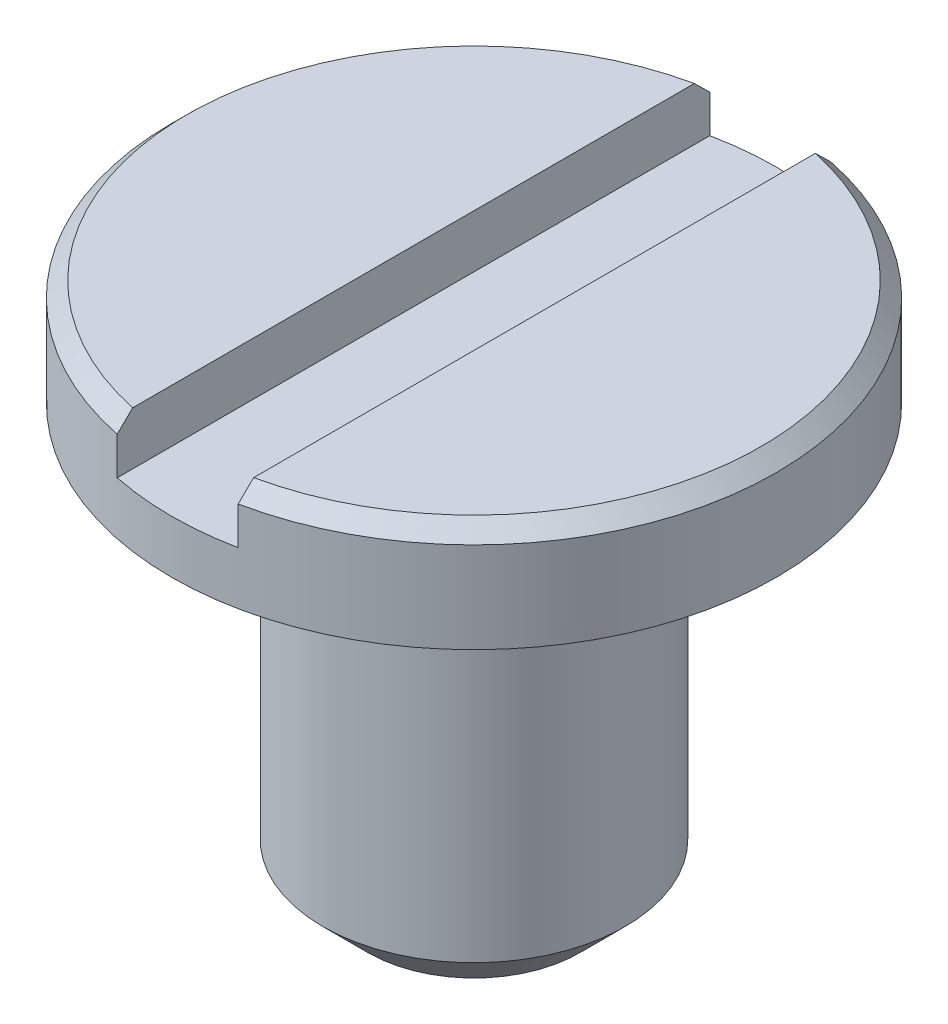
ISO-10303-21;
HEADER;
FILE_DESCRIPTION(('STEP AP214'),'2;1');
FILE_NAME('part.step','',(''),(''),'','','');
FILE_SCHEMA(('AUTOMOTIVE_DESIGN { 1 0 10303 214 1 1 1 1 }'));
ENDSEC;
DATA;
#1=APPLICATION_CONTEXT('core data for automotive mechanical design processes');
#2=APPLICATION_PROTOCOL_DEFINITION('international standard','automotive_design',2000,#1);
#3=PRODUCT_CONTEXT('',#1,'mechanical');
#4=PRODUCT('Part','Part','',(#3));
#5=PRODUCT_RELATED_PRODUCT_CATEGORY('part','',(#4));
#6=PRODUCT_DEFINITION_FORMATION('','',#4);
#7=PRODUCT_DEFINITION_CONTEXT('part definition',#1,'design');
#8=PRODUCT_DEFINITION('design','',#6,#7);
#9=PRODUCT_DEFINITION_SHAPE('','',#8);
#10=(LENGTH_UNIT() NAMED_UNIT(*) SI_UNIT(.MILLI.,.METRE.));
#11=(NAMED_UNIT(*) PLANE_ANGLE_UNIT() SI_UNIT($,.RADIAN.));
#12=(NAMED_UNIT(*) SI_UNIT($,.STERADIAN.) SOLID_ANGLE_UNIT());
#13=UNCERTAINTY_MEASURE_WITH_UNIT(LENGTH_MEASURE(1.E-05),#10,'distance_accuracy_value','');
#14=(GEOMETRIC_REPRESENTATION_CONTEXT(3) GLOBAL_UNCERTAINTY_ASSIGNED_CONTEXT((#13)) GLOBAL_UNIT_ASSIGNED_CONTEXT((#10,
#11,#12)) REPRESENTATION_CONTEXT('',''));
#15=CARTESIAN_POINT('',(0.,0.,0.));
#16=DIRECTION('',(0.,0.,1.));
#17=DIRECTION('',(1.,0.,0.));
#18=AXIS2_PLACEMENT_3D('',#15,#16,#17);
#19=CARTESIAN_POINT('',(0.,0.35,0.));
#20=DIRECTION('',(0.,1.,0.));
#21=DIRECTION('',(0.,0.,1.));
#22=AXIS2_PLACEMENT_3D('',#19,#20,#21);
#23=PLANE('',#22);
#24=DIRECTION('',(0.,0.,1.));
#25=VECTOR('',#24,1.);
#26=CARTESIAN_POINT('',(0.2,0.349999999999961,-1.));
#27=LINE('',#26,#25);
#28=CARTESIAN_POINT('',(0.2,0.350000000000183,-0.928708781050147));
#29=VERTEX_POINT('',#28);
#30=CARTESIAN_POINT('',(0.2,0.350000000000183,0.928708781050147));
#31=VERTEX_POINT('',#30);
#32=EDGE_CURVE('E103',#29,#31,#27,.T.);
#33=ORIENTED_EDGE('',*,*,#32,.T.);
#34=CARTESIAN_POINT('',(0.,0.35,0.));
#35=DIRECTION('',(0.,1.,0.));
#36=DIRECTION('',(0.,0.,1.));
#37=AXIS2_PLACEMENT_3D('',#34,#35,#36);
#38=CIRCLE('',#37,0.95);
#39=EDGE_CURVE('E106',#31,#29,#38,.T.);
#40=ORIENTED_EDGE('',*,*,#39,.T.);
#41=EDGE_LOOP('',(#33,#40));
#42=FACE_BOUND('',#41,.T.);
#43=ADVANCED_FACE('F35',(#42),#23,.T.);
#44=CARTESIAN_POINT('',(0.,0.35,0.));
#45=DIRECTION('',(0.,-1.,0.));
#46=DIRECTION('',(0.,0.,-1.));
#47=AXIS2_PLACEMENT_3D('',#44,#45,#46);
#48=CONICAL_SURFACE('',#47,0.95,0.785398163397444);
#49=CARTESIAN_POINT('',(0.199999999999843,-0.900574941424554,2.19146756143587));
#50=CARTESIAN_POINT('',(0.199999999999852,-0.822297483554492,2.11286169669059));
#51=CARTESIAN_POINT('',(0.199999999999862,-0.744034580814669,2.03424130603176));
#52=CARTESIAN_POINT('',(0.199999999999882,-0.58755265244806,1.87694498122661));
#53=CARTESIAN_POINT('',(0.199999999999892,-0.509333630609961,1.79826904331156));
#54=CARTESIAN_POINT('',(0.199999999999911,-0.352823379360022,1.6407033554736));
#55=CARTESIAN_POINT('',(0.199999999999921,-0.274532278895641,1.56181347745543));
#56=CARTESIAN_POINT('',(0.199999999999941,-0.118065304992818,1.40393099893837));
#57=CARTESIAN_POINT('',(0.199999999999951,-0.0398894234643721,1.32493840646403));
#58=CARTESIAN_POINT('',(0.19999999999997,0.111184069945873,1.17192994323873));
#59=CARTESIAN_POINT('',(0.199999999999979,0.184093329880202,1.09792557103058));
#60=CARTESIAN_POINT('',(0.199999999999997,0.329648871902699,0.949627019073654));
#61=CARTESIAN_POINT('',(0.200000000000007,0.402295095160597,0.875332781385784));
#62=CARTESIAN_POINT('',(0.20000000000002,0.510784860162763,0.763504441521916));
#63=CARTESIAN_POINT('',(0.200000000000025,0.546848732877298,0.726184202007795));
#64=CARTESIAN_POINT('',(0.200000000000034,0.618748266440063,0.651317873785591));
#65=CARTESIAN_POINT('',(0.200000000000038,0.654583908655757,0.6137717671124));
#66=CARTESIAN_POINT('',(0.200000000000047,0.72585323462357,0.538327864880469));
#67=CARTESIAN_POINT('',(0.200000000000052,0.761287068486657,0.500430210967292));
#68=CARTESIAN_POINT('',(0.200000000000061,0.831457230011381,0.423996124461889));
#69=CARTESIAN_POINT('',(0.200000000000065,0.866193679500583,0.38545980562482));
#70=CARTESIAN_POINT('',(0.20000000000007,0.909646518924265,0.335267539367016));
#71=CARTESIAN_POINT('',(0.200000000000072,0.91908540715021,0.32424039921212));
#72=CARTESIAN_POINT('',(0.200000000000074,0.937792972866582,0.30204207943419));
#73=CARTESIAN_POINT('',(0.200000000000075,0.9470616342785,0.290870886372764));
#74=CARTESIAN_POINT('',(0.200000000000079,0.974768252727341,0.256819433442021));
#75=CARTESIAN_POINT('',(0.200000000000081,0.992877589748001,0.233661890133097));
#76=CARTESIAN_POINT('',(0.200000000000084,1.01883923360336,0.197784956042036));
#77=CARTESIAN_POINT('',(0.200000000000085,1.02734877025673,0.185544759587543));
#78=CARTESIAN_POINT('',(0.200000000000087,1.04368421124464,0.160585431575704));
#79=CARTESIAN_POINT('',(0.200000000000088,1.05150918621037,0.147865681473237));
#80=CARTESIAN_POINT('',(0.20000000000009,1.06598025730171,0.121979559355896));
#81=CARTESIAN_POINT('',(0.200000000000091,1.07264064136359,0.108821371755681));
#82=CARTESIAN_POINT('',(0.200000000000092,1.08426732848776,0.0817843766003358));
#83=CARTESIAN_POINT('',(0.200000000000093,1.08923829824336,0.0679076781911866));
#84=CARTESIAN_POINT('',(0.200000000000094,1.09633872705625,0.0404790857899916));
#85=CARTESIAN_POINT('',(0.200000000000094,1.09864865153965,0.0269770493262806));
#86=CARTESIAN_POINT('',(0.200000000000094,1.10045557768087,-0.000192194105437006));
#87=CARTESIAN_POINT('',(0.200000000000094,1.09996042798101,-0.0138588335509856));
#88=CARTESIAN_POINT('',(0.200000000000094,1.09633594059135,-0.0406994110258927));
#89=CARTESIAN_POINT('',(0.200000000000094,1.09322723416128,-0.0538763664046339));
#90=CARTESIAN_POINT('',(0.200000000000093,1.08507163075124,-0.0796596345232106));
#91=CARTESIAN_POINT('',(0.200000000000092,1.08001412617033,-0.0922623944873008));
#92=CARTESIAN_POINT('',(0.200000000000091,1.06863290592905,-0.116829693760492));
#93=CARTESIAN_POINT('',(0.20000000000009,1.06231184605257,-0.128795506127727));
#94=CARTESIAN_POINT('',(0.200000000000088,1.04882674081917,-0.152248050180214));
#95=CARTESIAN_POINT('',(0.200000000000087,1.04166186088883,-0.163734292085573));
#96=CARTESIAN_POINT('',(0.200000000000084,1.01928794691207,-0.197724903971108));
#97=CARTESIAN_POINT('',(0.200000000000082,1.00324567361436,-0.219673720950425));
#98=CARTESIAN_POINT('',(0.200000000000078,0.969925079065192,-0.262938777871638));
#99=CARTESIAN_POINT('',(0.200000000000076,0.952635808908168,-0.284246269777341));
#100=CARTESIAN_POINT('',(0.200000000000071,0.917471931224986,-0.326280320619484));
#101=CARTESIAN_POINT('',(0.200000000000069,0.899598909488534,-0.347008208861824));
#102=CARTESIAN_POINT('',(0.200000000000062,0.846378374905583,-0.407609140512784));
#103=CARTESIAN_POINT('',(0.200000000000058,0.810511949262544,-0.44702277596639));
#104=CARTESIAN_POINT('',(0.200000000000049,0.738139321694224,-0.525260182754953));
#105=CARTESIAN_POINT('',(0.200000000000044,0.701633037108361,-0.564083876650287));
#106=CARTESIAN_POINT('',(0.200000000000035,0.628249130540292,-0.641403289806205));
#107=CARTESIAN_POINT('',(0.20000000000003,0.591371388733493,-0.679898895324435));
#108=CARTESIAN_POINT('',(0.200000000000021,0.517402206349087,-0.756679049326164));
#109=CARTESIAN_POINT('',(0.200000000000016,0.480310779046935,-0.794963610637924));
#110=CARTESIAN_POINT('',(0.200000000000002,0.368716643859296,-0.90973317725608));
#111=CARTESIAN_POINT('',(0.199999999999993,0.294006702304348,-0.986016558106763));
#112=CARTESIAN_POINT('',(0.199999999999974,0.144334632171811,-1.13831114541761));
#113=CARTESIAN_POINT('',(0.199999999999965,0.0693725451108567,-1.21432239280244));
#114=CARTESIAN_POINT('',(0.199999999999946,-0.0797635785888827,-1.36523984904066));
#115=CARTESIAN_POINT('',(0.199999999999937,-0.153935697110156,-1.4401479531131));
#116=CARTESIAN_POINT('',(0.199999999999918,-0.302336571433324,-1.58983557710067));
#117=CARTESIAN_POINT('',(0.199999999999909,-0.376565281993409,-1.66461514189977));
#118=CARTESIAN_POINT('',(0.19999999999989,-0.525713667959007,-1.81474656063727));
#119=CARTESIAN_POINT('',(0.19999999999988,-0.600633867728795,-1.89009789358902));
#120=CARTESIAN_POINT('',(0.199999999999861,-0.750556459019395,-2.04079322711245));
#121=CARTESIAN_POINT('',(0.199999999999852,-0.825558872880462,-2.11613720546016));
#122=CARTESIAN_POINT('',(0.199999999999843,-0.900574941424554,-2.19146756143587));
#123=B_SPLINE_CURVE_WITH_KNOTS('',3,(#49,#50,#51,#52,#53,#54,#55,#56,#57,#58,#59,#60,#61,#62,
#63,#64,#65,#66,#67,#68,#69,#70,#71,#72,#73,#74,#75,#76,#77,#78,#79,#80,#81,#82,#83,#84,#85,#86,
#87,#88,#89,#90,#91,#92,#93,#94,#95,#96,#97,#98,#99,#100,#101,#102,#103,#104,#105,#106,#107,
#108,#109,#110,#111,#112,#113,#114,#115,#116,#117,#118,#119,#120,#121,#122),.UNSPECIFIED.,.F.,
.F.,(4,2,2,2,2,2,2,2,2,2,2,2,2,2,2,2,2,2,2,2,2,2,2,2,2,2,2,2,2,2,2,2,2,2,2,2,4),(0.,
0.332800547318433,0.665626399288877,0.999059982971745,1.3324689185448,1.64412831664207,
1.95585357666665,2.11154720445383,2.26725338405876,2.42289933861197,2.57851786219807,
2.6220614304925,2.66560909069165,2.75374548435977,2.79845350185771,2.84322130290091,
2.88739401464767,2.93144369640404,2.97228762642037,3.0130173310153,3.05342850419007,
3.09406282159927,3.1346126138186,3.17520285371834,3.25667816980469,3.33898545365008,
3.4210852073893,3.58093715515335,3.74080990796271,3.90073599855422,4.06065225845546,
4.38097304700713,4.70124345020872,5.01749403983275,5.33359044829978,5.65236579570777,
5.97129944768147),.UNSPECIFIED.);
#124=CARTESIAN_POINT('',(0.199999999999994,0.299999999999999,0.979795897113272));
#125=VERTEX_POINT('',#124);
#126=EDGE_CURVE('E173',#125,#31,#123,.T.);
#127=ORIENTED_EDGE('',*,*,#126,.F.);
#128=CARTESIAN_POINT('',(0.,0.299999999999999,0.));
#129=DIRECTION('',(0.,1.,0.));
#130=DIRECTION('',(0.,0.,1.));
#131=AXIS2_PLACEMENT_3D('',#128,#129,#130);
#132=CIRCLE('',#131,1.);
#133=CARTESIAN_POINT('',(0.199999999999994,0.299999999999999,-0.979795897113272));
#134=VERTEX_POINT('',#133);
#135=EDGE_CURVE('E110',#134,#125,#132,.F.);
#136=ORIENTED_EDGE('',*,*,#135,.F.);
#137=EDGE_CURVE('E95',#29,#134,#123,.T.);
#138=ORIENTED_EDGE('',*,*,#137,.F.);
#139=ORIENTED_EDGE('',*,*,#39,.F.);
#140=EDGE_LOOP('',(#127,#136,#138,#139));
#141=FACE_BOUND('',#140,.T.);
#142=ADVANCED_FACE('F157',(#141),#48,.T.);
#143=CARTESIAN_POINT('',(0.,0.35,0.));
#144=DIRECTION('',(0.,-1.,0.));
#145=DIRECTION('',(0.,0.,-1.));
#146=AXIS2_PLACEMENT_3D('',#143,#144,#145);
#147=CYLINDRICAL_SURFACE('',#146,1.);
#148=CARTESIAN_POINT('',(0.,0.174999999999877,0.));
#149=DIRECTION('',(0.,-1.,0.));
#150=DIRECTION('',(0.,0.,-1.));
#151=AXIS2_PLACEMENT_3D('',#148,#149,#150);
#152=CIRCLE('',#151,1.);
#153=CARTESIAN_POINT('',(-0.199999999999978,0.174999999999877,-0.979795897113271));
#154=VERTEX_POINT('',#153);
#155=CARTESIAN_POINT('',(0.199999999999978,0.174999999999877,-0.979795897113276));
#156=VERTEX_POINT('',#155);
#157=EDGE_CURVE('E11',#154,#156,#152,.T.);
#158=ORIENTED_EDGE('',*,*,#157,.T.);
#159=DIRECTION('',(0.,-1.,0.));
#160=VECTOR('',#159,1.);
#161=CARTESIAN_POINT('',(0.2,0.349999999999975,-0.979795897113271));
#162=LINE('',#161,#160);
#163=EDGE_CURVE('E183',#156,#134,#162,.F.);
#164=ORIENTED_EDGE('',*,*,#163,.T.);
#165=ORIENTED_EDGE('',*,*,#135,.T.);
#166=DIRECTION('',(0.,-1.,0.));
#167=VECTOR('',#166,1.);
#168=CARTESIAN_POINT('',(0.2,0.349999999999975,0.979795897113271));
#169=LINE('',#168,#167);
#170=CARTESIAN_POINT('',(0.199999999999978,0.174999999999877,0.979795897113276));
#171=VERTEX_POINT('',#170);
#172=EDGE_CURVE('E58',#125,#171,#169,.T.);
#173=ORIENTED_EDGE('',*,*,#172,.T.);
#174=CARTESIAN_POINT('',(-0.199999999999978,0.174999999999877,0.979795897113271));
#175=VERTEX_POINT('',#174);
#176=EDGE_CURVE('E39',#171,#175,#152,.T.);
#177=ORIENTED_EDGE('',*,*,#176,.T.);
#178=DIRECTION('',(0.,-1.,0.));
#179=VECTOR('',#178,1.);
#180=CARTESIAN_POINT('',(-0.2,0.349999999999975,0.979795897113271));
#181=LINE('',#180,#179);
#182=CARTESIAN_POINT('',(-0.199999999999994,0.299999999999999,0.979795897113272));
#183=VERTEX_POINT('',#182);
#184=EDGE_CURVE('E178',#175,#183,#181,.F.);
#185=ORIENTED_EDGE('',*,*,#184,.T.);
#186=CARTESIAN_POINT('',(-0.199999999999994,0.299999999999999,-0.979795897113272));
#187=VERTEX_POINT('',#186);
#188=EDGE_CURVE('E118',#183,#187,#132,.F.);
#189=ORIENTED_EDGE('',*,*,#188,.T.);
#190=DIRECTION('',(0.,-1.,0.));
#191=VECTOR('',#190,1.);
#192=CARTESIAN_POINT('',(-0.2,0.349999999999975,-0.979795897113271));
#193=LINE('',#192,#191);
#194=EDGE_CURVE('E90',#187,#154,#193,.T.);
#195=ORIENTED_EDGE('',*,*,#194,.T.);
#196=EDGE_LOOP('',(#158,#164,#165,#173,#177,#185,#189,#195));
#197=FACE_BOUND('',#196,.T.);
#198=CARTESIAN_POINT('',(0.,0.,0.));
#199=DIRECTION('',(0.,1.,0.));
#200=DIRECTION('',(0.,0.,1.));
#201=AXIS2_PLACEMENT_3D('',#198,#199,#200);
#202=CIRCLE('',#201,1.);
#203=CARTESIAN_POINT('',(0.,0.,1.));
#204=VERTEX_POINT('',#203);
#205=EDGE_CURVE('E107',#204,#204,#202,.T.);
#206=ORIENTED_EDGE('',*,*,#205,.T.);
#207=EDGE_LOOP('',(#206));
#208=FACE_BOUND('',#207,.T.);
#209=ADVANCED_FACE('F153',(#197,#208),#147,.T.);
#210=DIRECTION('',(0.,0.,1.));
#211=VECTOR('',#210,1.);
#212=CARTESIAN_POINT('',(-0.2,0.349999999999961,-1.));
#213=LINE('',#212,#211);
#214=CARTESIAN_POINT('',(-0.2,0.349999999999961,-0.928708781050374));
#215=VERTEX_POINT('',#214);
#216=CARTESIAN_POINT('',(-0.199999999999992,0.35,0.928708781050337));
#217=VERTEX_POINT('',#216);
#218=EDGE_CURVE('E50',#215,#217,#213,.T.);
#219=ORIENTED_EDGE('',*,*,#218,.F.);
#220=EDGE_CURVE('E101',#215,#217,#38,.T.);
#221=ORIENTED_EDGE('',*,*,#220,.T.);
#222=EDGE_LOOP('',(#219,#221));
#223=FACE_BOUND('',#222,.T.);
#224=ADVANCED_FACE('F100',(#223),#23,.T.);
#225=CARTESIAN_POINT('',(0.,0.,0.));
#226=DIRECTION('',(0.,1.,0.));
#227=DIRECTION('',(0.,0.,1.));
#228=AXIS2_PLACEMENT_3D('',#225,#226,#227);
#229=PLANE('',#228);
#230=CARTESIAN_POINT('',(0.,0.,0.));
#231=DIRECTION('',(0.,1.,0.));
#232=DIRECTION('',(0.,0.,1.));
#233=AXIS2_PLACEMENT_3D('',#230,#231,#232);
#234=CIRCLE('',#233,0.5);
#235=CARTESIAN_POINT('',(0.,0.,0.5));
#236=VERTEX_POINT('',#235);
#237=EDGE_CURVE('E112',#236,#236,#234,.T.);
#238=ORIENTED_EDGE('',*,*,#237,.T.);
#239=EDGE_LOOP('',(#238));
#240=FACE_BOUND('',#239,.T.);
#241=ORIENTED_EDGE('',*,*,#205,.F.);
#242=EDGE_LOOP('',(#241));
#243=FACE_BOUND('',#242,.T.);
#244=ADVANCED_FACE('F149',(#240,#243),#229,.F.);
#245=CARTESIAN_POINT('',(0.,-1.4,0.));
#246=DIRECTION('',(0.,1.,0.));
#247=DIRECTION('',(0.,0.,1.));
#248=AXIS2_PLACEMENT_3D('',#245,#246,#247);
#249=CYLINDRICAL_SURFACE('',#248,0.5);
#250=CARTESIAN_POINT('',(0.,-1.25,0.));
#251=DIRECTION('',(0.,1.,0.));
#252=DIRECTION('',(0.,0.,1.));
#253=AXIS2_PLACEMENT_3D('',#250,#251,#252);
#254=CIRCLE('',#253,0.5);
#255=CARTESIAN_POINT('',(0.,-1.25,0.5));
#256=VERTEX_POINT('',#255);
#257=EDGE_CURVE('E119',#256,#256,#254,.T.);
#258=ORIENTED_EDGE('',*,*,#257,.T.);
#259=EDGE_LOOP('',(#258));
#260=FACE_BOUND('',#259,.T.);
#261=ORIENTED_EDGE('',*,*,#237,.F.);
#262=EDGE_LOOP('',(#261));
#263=FACE_BOUND('',#262,.T.);
#264=ADVANCED_FACE('F145',(#260,#263),#249,.T.);
#265=CARTESIAN_POINT('',(0.,-1.4,0.));
#266=DIRECTION('',(0.,1.,0.));
#267=DIRECTION('',(0.,0.,1.));
#268=AXIS2_PLACEMENT_3D('',#265,#266,#267);
#269=PLANE('',#268);
#270=CARTESIAN_POINT('',(0.,-1.4,0.));
#271=DIRECTION('',(0.,1.,0.));
#272=DIRECTION('',(0.,0.,1.));
#273=AXIS2_PLACEMENT_3D('',#270,#271,#272);
#274=CIRCLE('',#273,0.35);
#275=CARTESIAN_POINT('',(0.,-1.4,0.35));
#276=VERTEX_POINT('',#275);
#277=EDGE_CURVE('E122',#276,#276,#274,.F.);
#278=ORIENTED_EDGE('',*,*,#277,.T.);
#279=EDGE_LOOP('',(#278));
#280=FACE_BOUND('',#279,.T.);
#281=ADVANCED_FACE('F142',(#280),#269,.F.);
#282=CARTESIAN_POINT('',(-0.199999999999843,-0.900574941424557,-2.19146756143588));
#283=CARTESIAN_POINT('',(-0.199999999999852,-0.822297483554494,-2.1128616966906));
#284=CARTESIAN_POINT('',(-0.199999999999862,-0.74403458081467,-2.03424130603176));
#285=CARTESIAN_POINT('',(-0.199999999999882,-0.587552652448061,-1.87694498122661));
#286=CARTESIAN_POINT('',(-0.199999999999892,-0.509333630609962,-1.79826904331156));
#287=CARTESIAN_POINT('',(-0.199999999999911,-0.352823379360022,-1.6407033554736));
#288=CARTESIAN_POINT('',(-0.199999999999921,-0.274532278895641,-1.56181347745543));
#289=CARTESIAN_POINT('',(-0.199999999999941,-0.118065304992818,-1.40393099893837));
#290=CARTESIAN_POINT('',(-0.199999999999951,-0.0398894234643718,-1.32493840646402));
#291=CARTESIAN_POINT('',(-0.19999999999997,0.111184069945873,-1.17192994323873));
#292=CARTESIAN_POINT('',(-0.199999999999979,0.184093329880203,-1.09792557103058));
#293=CARTESIAN_POINT('',(-0.199999999999997,0.3296488719027,-0.949627019073654));
#294=CARTESIAN_POINT('',(-0.200000000000007,0.402295095160597,-0.875332781385784));
#295=CARTESIAN_POINT('',(-0.20000000000002,0.510784860162763,-0.763504441521916));
#296=CARTESIAN_POINT('',(-0.200000000000025,0.546848732877298,-0.726184202007795));
#297=CARTESIAN_POINT('',(-0.200000000000034,0.618748266440063,-0.651317873785591));
#298=CARTESIAN_POINT('',(-0.200000000000038,0.654583908655757,-0.6137717671124));
#299=CARTESIAN_POINT('',(-0.200000000000047,0.72585323462357,-0.538327864880469));
#300=CARTESIAN_POINT('',(-0.200000000000052,0.761287068486657,-0.500430210967292));
#301=CARTESIAN_POINT('',(-0.200000000000061,0.831457230011381,-0.423996124461889));
#302=CARTESIAN_POINT('',(-0.200000000000065,0.866193679500583,-0.385459805624821));
#303=CARTESIAN_POINT('',(-0.20000000000007,0.909646518924264,-0.335267539367016));
#304=CARTESIAN_POINT('',(-0.200000000000072,0.919085407150209,-0.324240399212121));
#305=CARTESIAN_POINT('',(-0.200000000000074,0.937792972866581,-0.302042079434191));
#306=CARTESIAN_POINT('',(-0.200000000000075,0.947061634278499,-0.290870886372765));
#307=CARTESIAN_POINT('',(-0.200000000000079,0.974768252727341,-0.256819433442022));
#308=CARTESIAN_POINT('',(-0.200000000000081,0.992877589748001,-0.233661890133097));
#309=CARTESIAN_POINT('',(-0.200000000000084,1.01883923360336,-0.197784956042037));
#310=CARTESIAN_POINT('',(-0.200000000000085,1.02734877025673,-0.185544759587544));
#311=CARTESIAN_POINT('',(-0.200000000000087,1.04368421124464,-0.160585431575704));
#312=CARTESIAN_POINT('',(-0.200000000000088,1.05150918621037,-0.147865681473237));
#313=CARTESIAN_POINT('',(-0.20000000000009,1.06598025730171,-0.121979559355896));
#314=CARTESIAN_POINT('',(-0.200000000000091,1.07264064136359,-0.108821371755681));
#315=CARTESIAN_POINT('',(-0.200000000000092,1.08426732848776,-0.0817843766003359));
#316=CARTESIAN_POINT('',(-0.200000000000093,1.08923829824336,-0.0679076781911868));
#317=CARTESIAN_POINT('',(-0.200000000000094,1.09633872705625,-0.0404790857899919));
#318=CARTESIAN_POINT('',(-0.200000000000094,1.09864865153965,-0.0269770493262808));
#319=CARTESIAN_POINT('',(-0.200000000000094,1.10045557768087,0.000192194105436833));
#320=CARTESIAN_POINT('',(-0.200000000000094,1.09996042798101,0.0138588335509854));
#321=CARTESIAN_POINT('',(-0.200000000000094,1.09633594059135,0.0406994110258925));
#322=CARTESIAN_POINT('',(-0.200000000000094,1.09322723416128,0.0538763664046338));
#323=CARTESIAN_POINT('',(-0.200000000000093,1.08507163075124,0.0796596345232105));
#324=CARTESIAN_POINT('',(-0.200000000000092,1.08001412617033,0.0922623944873008));
#325=CARTESIAN_POINT('',(-0.200000000000091,1.06863290592905,0.116829693760492));
#326=CARTESIAN_POINT('',(-0.20000000000009,1.06231184605257,0.128795506127727));
#327=CARTESIAN_POINT('',(-0.200000000000088,1.04882674081917,0.152248050180214));
#328=CARTESIAN_POINT('',(-0.200000000000087,1.04166186088883,0.163734292085573));
#329=CARTESIAN_POINT('',(-0.200000000000084,1.01928794691207,0.197724903971108));
#330=CARTESIAN_POINT('',(-0.200000000000082,1.00324567361436,0.219673720950425));
#331=CARTESIAN_POINT('',(-0.200000000000078,0.969925079065192,0.262938777871638));
#332=CARTESIAN_POINT('',(-0.200000000000076,0.952635808908168,0.284246269777341));
#333=CARTESIAN_POINT('',(-0.200000000000071,0.917471931224986,0.326280320619484));
#334=CARTESIAN_POINT('',(-0.200000000000069,0.899598909488534,0.347008208861824));
#335=CARTESIAN_POINT('',(-0.200000000000062,0.846378374905583,0.407609140512784));
#336=CARTESIAN_POINT('',(-0.200000000000058,0.810511949262545,0.447022775966389));
#337=CARTESIAN_POINT('',(-0.200000000000049,0.738139321694224,0.525260182754952));
#338=CARTESIAN_POINT('',(-0.200000000000044,0.701633037108361,0.564083876650286));
#339=CARTESIAN_POINT('',(-0.200000000000035,0.628249130540293,0.641403289806204));
#340=CARTESIAN_POINT('',(-0.20000000000003,0.591371388733494,0.679898895324435));
#341=CARTESIAN_POINT('',(-0.200000000000021,0.517402206349088,0.756679049326164));
#342=CARTESIAN_POINT('',(-0.200000000000016,0.480310779046935,0.794963610637924));
#343=CARTESIAN_POINT('',(-0.200000000000002,0.368716643859297,0.909733177256079));
#344=CARTESIAN_POINT('',(-0.199999999999993,0.294006702304348,0.986016558106762));
#345=CARTESIAN_POINT('',(-0.199999999999974,0.144334632171812,1.13831114541761));
#346=CARTESIAN_POINT('',(-0.199999999999965,0.0693725451108577,1.21432239280244));
#347=CARTESIAN_POINT('',(-0.199999999999946,-0.0797635785888818,1.36523984904065));
#348=CARTESIAN_POINT('',(-0.199999999999937,-0.153935697110155,1.4401479531131));
#349=CARTESIAN_POINT('',(-0.199999999999918,-0.302336571433324,1.58983557710067));
#350=CARTESIAN_POINT('',(-0.199999999999909,-0.37656528199341,1.66461514189977));
#351=CARTESIAN_POINT('',(-0.19999999999989,-0.525713667959008,1.81474656063727));
#352=CARTESIAN_POINT('',(-0.19999999999988,-0.600633867728795,1.89009789358902));
#353=CARTESIAN_POINT('',(-0.199999999999861,-0.750556459019396,2.04079322711245));
#354=CARTESIAN_POINT('',(-0.199999999999852,-0.825558872880464,2.11613720546016));
#355=CARTESIAN_POINT('',(-0.199999999999843,-0.900574941424557,2.19146756143588));
#356=B_SPLINE_CURVE_WITH_KNOTS('',3,(#282,#283,#284,#285,#286,#287,#288,#289,#290,#291,#292,
#293,#294,#295,#296,#297,#298,#299,#300,#301,#302,#303,#304,#305,#306,#307,#308,#309,#310,#311,
#312,#313,#314,#315,#316,#317,#318,#319,#320,#321,#322,#323,#324,#325,#326,#327,#328,#329,#330,
#331,#332,#333,#334,#335,#336,#337,#338,#339,#340,#341,#342,#343,#344,#345,#346,#347,#348,#349,
#350,#351,#352,#353,#354,#355),.UNSPECIFIED.,.F.,.F.,(4,2,2,2,2,2,2,2,2,2,2,2,2,2,2,2,2,2,2,2,2,
2,2,2,2,2,2,2,2,2,2,2,2,2,2,2,4),(0.,0.332800547318435,0.665626399288879,0.999059982971747,
1.3324689185448,1.64412831664208,1.95585357666665,2.11154720445384,2.26725338405876,
2.42289933861197,2.57851786219807,2.6220614304925,2.66560909069166,2.75374548435977,
2.79845350185771,2.84322130290092,2.88739401464767,2.93144369640404,2.97228762642037,
3.01301733101531,3.05342850419008,3.09406282159927,3.1346126138186,3.17520285371834,
3.25667816980469,3.33898545365008,3.42108520738931,3.58093715515335,3.74080990796272,
3.90073599855423,4.06065225845547,4.38097304700713,4.70124345020872,5.01749403983275,
5.33359044829979,5.65236579570778,5.97129944768147),.UNSPECIFIED.);
#357=EDGE_CURVE('E86',#187,#215,#356,.T.);
#358=ORIENTED_EDGE('',*,*,#357,.F.);
#359=ORIENTED_EDGE('',*,*,#188,.F.);
#360=EDGE_CURVE('E96',#217,#183,#356,.T.);
#361=ORIENTED_EDGE('',*,*,#360,.F.);
#362=ORIENTED_EDGE('',*,*,#220,.F.);
#363=EDGE_LOOP('',(#358,#359,#361,#362));
#364=FACE_BOUND('',#363,.T.);
#365=ADVANCED_FACE('F105',(#364),#48,.T.);
#366=CARTESIAN_POINT('',(0.,-1.25,0.));
#367=DIRECTION('',(0.,1.,0.));
#368=DIRECTION('',(0.,0.,1.));
#369=AXIS2_PLACEMENT_3D('',#366,#367,#368);
#370=CONICAL_SURFACE('',#369,0.5,0.785398163397453);
#371=ORIENTED_EDGE('',*,*,#277,.F.);
#372=EDGE_LOOP('',(#371));
#373=FACE_BOUND('',#372,.T.);
#374=ORIENTED_EDGE('',*,*,#257,.F.);
#375=EDGE_LOOP('',(#374));
#376=FACE_BOUND('',#375,.T.);
#377=ADVANCED_FACE('F37',(#373,#376),#370,.T.);
#378=CARTESIAN_POINT('',(0.199999999999978,0.174999999999877,-1.));
#379=DIRECTION('',(0.,-1.,0.));
#380=DIRECTION('',(0.,0.,-1.));
#381=AXIS2_PLACEMENT_3D('',#378,#379,#380);
#382=PLANE('',#381);
#383=DIRECTION('',(0.,0.,1.));
#384=VECTOR('',#383,1.);
#385=CARTESIAN_POINT('',(0.199999999999978,0.174999999999877,-1.));
#386=LINE('',#385,#384);
#387=EDGE_CURVE('E182',#156,#171,#386,.T.);
#388=ORIENTED_EDGE('',*,*,#387,.F.);
#389=ORIENTED_EDGE('',*,*,#157,.F.);
#390=DIRECTION('',(0.,0.,1.));
#391=VECTOR('',#390,1.);
#392=CARTESIAN_POINT('',(-0.199999999999978,0.174999999999877,-1.));
#393=LINE('',#392,#391);
#394=EDGE_CURVE('E102',#154,#175,#393,.T.);
#395=ORIENTED_EDGE('',*,*,#394,.T.);
#396=ORIENTED_EDGE('',*,*,#176,.F.);
#397=EDGE_LOOP('',(#388,#389,#395,#396));
#398=FACE_BOUND('',#397,.T.);
#399=ADVANCED_FACE('F138',(#398),#382,.F.);
#400=CARTESIAN_POINT('',(0.2,0.349999999999961,-1.));
#401=DIRECTION('',(1.,-1.25922338032899E-13,0.));
#402=DIRECTION('',(1.25922338032899E-13,1.,0.));
#403=AXIS2_PLACEMENT_3D('',#400,#401,#402);
#404=PLANE('',#403);
#405=ORIENTED_EDGE('',*,*,#126,.T.);
#406=ORIENTED_EDGE('',*,*,#32,.F.);
#407=ORIENTED_EDGE('',*,*,#137,.T.);
#408=ORIENTED_EDGE('',*,*,#163,.F.);
#409=ORIENTED_EDGE('',*,*,#387,.T.);
#410=ORIENTED_EDGE('',*,*,#172,.F.);
#411=EDGE_LOOP('',(#405,#406,#407,#408,#409,#410));
#412=FACE_BOUND('',#411,.T.);
#413=ADVANCED_FACE('F137',(#412),#404,.F.);
#414=CARTESIAN_POINT('',(-0.2,0.349999999999961,-1.));
#415=DIRECTION('',(-1.,-1.25922338032899E-13,0.));
#416=DIRECTION('',(1.25922338032899E-13,-1.,0.));
#417=AXIS2_PLACEMENT_3D('',#414,#415,#416);
#418=PLANE('',#417);
#419=ORIENTED_EDGE('',*,*,#357,.T.);
#420=ORIENTED_EDGE('',*,*,#218,.T.);
#421=ORIENTED_EDGE('',*,*,#360,.T.);
#422=ORIENTED_EDGE('',*,*,#184,.F.);
#423=ORIENTED_EDGE('',*,*,#394,.F.);
#424=ORIENTED_EDGE('',*,*,#194,.F.);
#425=EDGE_LOOP('',(#419,#420,#421,#422,#423,#424));
#426=FACE_BOUND('',#425,.T.);
#427=ADVANCED_FACE('F87',(#426),#418,.F.);
#428=CLOSED_SHELL('',(#43,#142,#209,#224,#244,#264,#281,#365,#377,#399,#413,#427));
#429=MANIFOLD_SOLID_BREP('B2',#428);
#430=ADVANCED_BREP_SHAPE_REPRESENTATION('',(#18,#429),#14);
#431=SHAPE_DEFINITION_REPRESENTATION(#9,#430);
ENDSEC;
END-ISO-10303-21;
